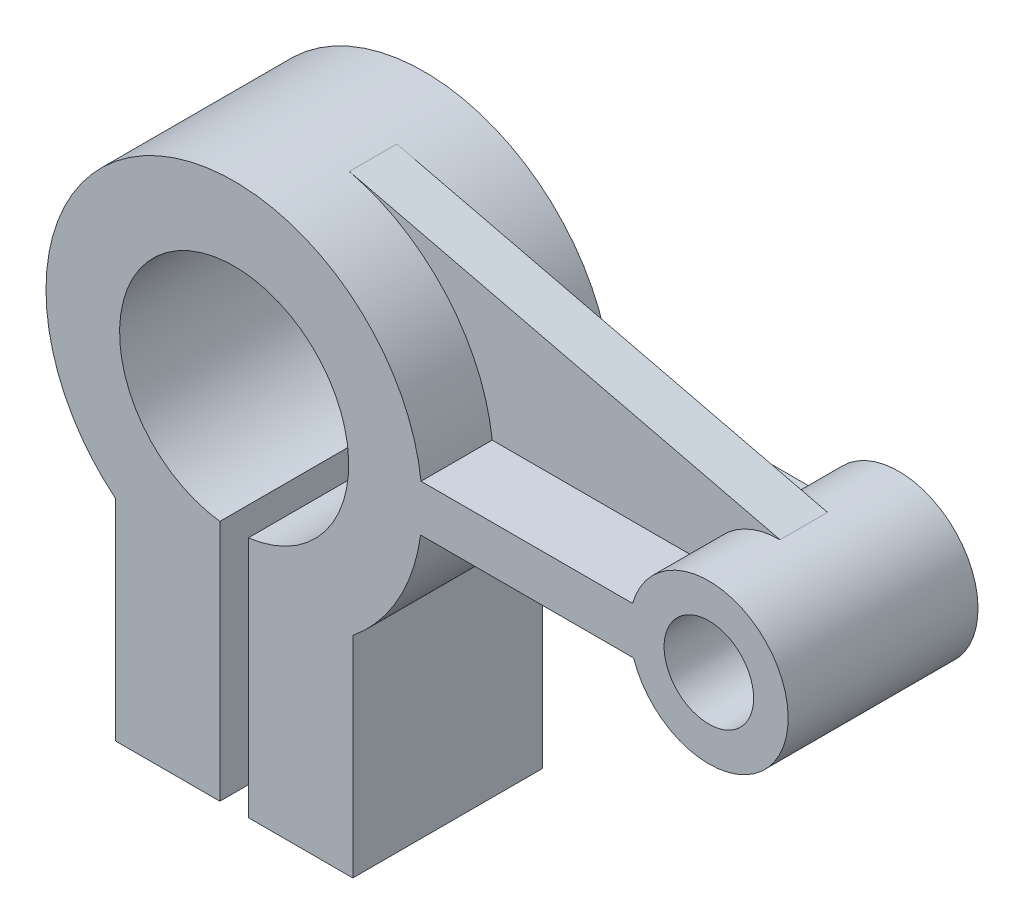
ISO-10303-21;
HEADER;
FILE_DESCRIPTION(('STEP AP214'),'2;1');
FILE_NAME('part.step','',(''),(''),'','','');
FILE_SCHEMA(('AUTOMOTIVE_DESIGN { 1 0 10303 214 1 1 1 1 }'));
ENDSEC;
DATA;
#1=APPLICATION_CONTEXT('core data for automotive mechanical design processes');
#2=APPLICATION_PROTOCOL_DEFINITION('international standard','automotive_design',2000,#1);
#3=PRODUCT_CONTEXT('',#1,'mechanical');
#4=PRODUCT('Part','Part','',(#3));
#5=PRODUCT_RELATED_PRODUCT_CATEGORY('part','',(#4));
#6=PRODUCT_DEFINITION_FORMATION('','',#4);
#7=PRODUCT_DEFINITION_CONTEXT('part definition',#1,'design');
#8=PRODUCT_DEFINITION('design','',#6,#7);
#9=PRODUCT_DEFINITION_SHAPE('','',#8);
#10=(LENGTH_UNIT() NAMED_UNIT(*) SI_UNIT(.MILLI.,.METRE.));
#11=(NAMED_UNIT(*) PLANE_ANGLE_UNIT() SI_UNIT($,.RADIAN.));
#12=(NAMED_UNIT(*) SI_UNIT($,.STERADIAN.) SOLID_ANGLE_UNIT());
#13=UNCERTAINTY_MEASURE_WITH_UNIT(LENGTH_MEASURE(1.E-05),#10,'distance_accuracy_value','');
#14=(GEOMETRIC_REPRESENTATION_CONTEXT(3) GLOBAL_UNCERTAINTY_ASSIGNED_CONTEXT((#13)) GLOBAL_UNIT_ASSIGNED_CONTEXT((#10,
#11,#12)) REPRESENTATION_CONTEXT('',''));
#15=CARTESIAN_POINT('',(0.,0.,0.));
#16=DIRECTION('',(0.,0.,1.));
#17=DIRECTION('',(1.,0.,0.));
#18=AXIS2_PLACEMENT_3D('',#15,#16,#17);
#19=CARTESIAN_POINT('',(-47.8154748154259,9.85006555532837,20.));
#20=DIRECTION('',(0.,1.,0.));
#21=DIRECTION('',(-1.,0.,0.));
#22=AXIS2_PLACEMENT_3D('',#19,#20,#21);
#23=PLANE('',#22);
#24=DIRECTION('',(0.,0.,-1.));
#25=VECTOR('',#24,1.);
#26=CARTESIAN_POINT('',(-47.8154748154259,9.85006555532837,20.));
#27=LINE('',#26,#25);
#28=CARTESIAN_POINT('',(-47.8154748154259,9.85006555532837,-5.));
#29=VERTEX_POINT('',#28);
#30=CARTESIAN_POINT('',(-47.8154748154259,9.85006555532837,-20.));
#31=VERTEX_POINT('',#30);
#32=EDGE_CURVE('E158',#29,#31,#27,.T.);
#33=ORIENTED_EDGE('',*,*,#32,.F.);
#34=DIRECTION('',(1.,0.,0.));
#35=VECTOR('',#34,1.);
#36=CARTESIAN_POINT('',(-47.8154748154259,9.85006555532837,-5.));
#37=LINE('',#36,#35);
#38=CARTESIAN_POINT('',(-3.24864638397685,9.85006555532837,-5.));
#39=VERTEX_POINT('',#38);
#40=EDGE_CURVE('E157',#29,#39,#37,.T.);
#41=ORIENTED_EDGE('',*,*,#40,.T.);
#42=DIRECTION('',(0.,0.,-1.));
#43=VECTOR('',#42,1.);
#44=CARTESIAN_POINT('',(-3.24864638397685,9.85006555532838,20.));
#45=LINE('',#44,#43);
#46=CARTESIAN_POINT('',(-3.24864638397685,9.85006555532838,-20.));
#47=VERTEX_POINT('',#46);
#48=EDGE_CURVE('E142',#39,#47,#45,.T.);
#49=ORIENTED_EDGE('',*,*,#48,.T.);
#50=DIRECTION('',(1.,0.,0.));
#51=VECTOR('',#50,1.);
#52=CARTESIAN_POINT('',(-47.8154748154259,9.85006555532837,-20.));
#53=LINE('',#52,#51);
#54=EDGE_CURVE('E183',#31,#47,#53,.T.);
#55=ORIENTED_EDGE('',*,*,#54,.F.);
#56=EDGE_LOOP('',(#33,#41,#49,#55));
#57=FACE_BOUND('',#56,.T.);
#58=ADVANCED_FACE('F32',(#57),#23,.T.);
#59=DIRECTION('',(1.,0.,0.));
#60=VECTOR('',#59,1.);
#61=CARTESIAN_POINT('',(-47.8154748154259,9.85006555532837,5.));
#62=LINE('',#61,#60);
#63=CARTESIAN_POINT('',(-47.8154748154259,9.85006555532837,5.));
#64=VERTEX_POINT('',#63);
#65=CARTESIAN_POINT('',(-3.24864638397685,9.85006555532838,5.));
#66=VERTEX_POINT('',#65);
#67=EDGE_CURVE('E167',#64,#66,#62,.T.);
#68=ORIENTED_EDGE('',*,*,#67,.F.);
#69=CARTESIAN_POINT('',(-47.8154748154259,9.85006555532837,20.));
#70=VERTEX_POINT('',#69);
#71=EDGE_CURVE('E40',#70,#64,#27,.T.);
#72=ORIENTED_EDGE('',*,*,#71,.F.);
#73=DIRECTION('',(1.,0.,0.));
#74=VECTOR('',#73,1.);
#75=CARTESIAN_POINT('',(-47.8154748154259,9.85006555532837,20.));
#76=LINE('',#75,#74);
#77=CARTESIAN_POINT('',(-3.24864638397685,9.85006555532838,20.));
#78=VERTEX_POINT('',#77);
#79=EDGE_CURVE('E186',#70,#78,#76,.T.);
#80=ORIENTED_EDGE('',*,*,#79,.T.);
#81=EDGE_CURVE('E153',#78,#66,#45,.T.);
#82=ORIENTED_EDGE('',*,*,#81,.T.);
#83=EDGE_LOOP('',(#68,#72,#80,#82));
#84=FACE_BOUND('',#83,.T.);
#85=ADVANCED_FACE('F34',(#84),#23,.T.);
#86=CARTESIAN_POINT('',(-87.1826991693036,5.28960174940764,20.));
#87=DIRECTION('',(0.,0.,-1.));
#88=DIRECTION('',(-1.,0.,0.));
#89=AXIS2_PLACEMENT_3D('',#86,#87,#88);
#90=CYLINDRICAL_SURFACE('',#89,39.630495624628);
#91=CARTESIAN_POINT('',(-87.1826991693036,5.28960174940764,5.));
#92=DIRECTION('',(0.,0.,1.));
#93=DIRECTION('',(1.,0.,0.));
#94=AXIS2_PLACEMENT_3D('',#91,#92,#93);
#95=CIRCLE('',#94,39.630495624628);
#96=CARTESIAN_POINT('',(-77.9118512435752,43.8204668083662,5.));
#97=VERTEX_POINT('',#96);
#98=EDGE_CURVE('E47',#64,#97,#95,.T.);
#99=ORIENTED_EDGE('',*,*,#98,.T.);
#100=DIRECTION('',(0.,0.,-1.));
#101=VECTOR('',#100,1.);
#102=CARTESIAN_POINT('',(-77.9118512435752,43.8204668083662,20.));
#103=LINE('',#102,#101);
#104=CARTESIAN_POINT('',(-77.9118512435752,43.8204668083662,-5.));
#105=VERTEX_POINT('',#104);
#106=EDGE_CURVE('E51',#105,#97,#103,.F.);
#107=ORIENTED_EDGE('',*,*,#106,.F.);
#108=CARTESIAN_POINT('',(-87.1826991693036,5.28960174940764,-5.));
#109=DIRECTION('',(0.,0.,1.));
#110=DIRECTION('',(1.,0.,0.));
#111=AXIS2_PLACEMENT_3D('',#108,#109,#110);
#112=CIRCLE('',#111,39.630495624628);
#113=EDGE_CURVE('E160',#29,#105,#112,.T.);
#114=ORIENTED_EDGE('',*,*,#113,.F.);
#115=ORIENTED_EDGE('',*,*,#32,.T.);
#116=CARTESIAN_POINT('',(-87.1826991693036,5.28960174940764,-20.));
#117=DIRECTION('',(0.,0.,1.));
#118=DIRECTION('',(1.,0.,0.));
#119=AXIS2_PLACEMENT_3D('',#116,#117,#118);
#120=CIRCLE('',#119,39.630495624628);
#121=CARTESIAN_POINT('',(-112.182699169304,-25.4606207449688,-20.));
#122=VERTEX_POINT('',#121);
#123=EDGE_CURVE('E190',#31,#122,#120,.T.);
#124=ORIENTED_EDGE('',*,*,#123,.T.);
#125=DIRECTION('',(0.,0.,-1.));
#126=VECTOR('',#125,1.);
#127=CARTESIAN_POINT('',(-112.182699169304,-25.4606207449688,20.));
#128=LINE('',#127,#126);
#129=CARTESIAN_POINT('',(-112.182699169304,-25.4606207449688,20.));
#130=VERTEX_POINT('',#129);
#131=EDGE_CURVE('E248',#130,#122,#128,.T.);
#132=ORIENTED_EDGE('',*,*,#131,.F.);
#133=CARTESIAN_POINT('',(-87.1826991693036,5.28960174940764,20.));
#134=DIRECTION('',(0.,0.,1.));
#135=DIRECTION('',(1.,0.,0.));
#136=AXIS2_PLACEMENT_3D('',#133,#134,#135);
#137=CIRCLE('',#136,39.630495624628);
#138=EDGE_CURVE('E154',#70,#130,#137,.T.);
#139=ORIENTED_EDGE('',*,*,#138,.F.);
#140=ORIENTED_EDGE('',*,*,#71,.T.);
#141=EDGE_LOOP('',(#99,#107,#114,#115,#124,#132,#139,#140));
#142=FACE_BOUND('',#141,.T.);
#143=ADVANCED_FACE('F295',(#142),#90,.T.);
#144=CARTESIAN_POINT('',(-112.182699169304,-69.7103982505924,20.));
#145=DIRECTION('',(-1.,0.,0.));
#146=DIRECTION('',(0.,0.,1.));
#147=AXIS2_PLACEMENT_3D('',#144,#145,#146);
#148=PLANE('',#147);
#149=ORIENTED_EDGE('',*,*,#131,.T.);
#150=DIRECTION('',(0.,1.,0.));
#151=VECTOR('',#150,1.);
#152=CARTESIAN_POINT('',(-112.182699169304,-69.7103982505924,-20.));
#153=LINE('',#152,#151);
#154=CARTESIAN_POINT('',(-112.182699169304,-69.7103982505924,-20.));
#155=VERTEX_POINT('',#154);
#156=EDGE_CURVE('E242',#155,#122,#153,.T.);
#157=ORIENTED_EDGE('',*,*,#156,.F.);
#158=DIRECTION('',(0.,0.,-1.));
#159=VECTOR('',#158,1.);
#160=CARTESIAN_POINT('',(-112.182699169304,-69.7103982505924,20.));
#161=LINE('',#160,#159);
#162=CARTESIAN_POINT('',(-112.182699169304,-69.7103982505924,20.));
#163=VERTEX_POINT('',#162);
#164=EDGE_CURVE('E250',#163,#155,#161,.T.);
#165=ORIENTED_EDGE('',*,*,#164,.F.);
#166=DIRECTION('',(0.,1.,0.));
#167=VECTOR('',#166,1.);
#168=CARTESIAN_POINT('',(-112.182699169304,-69.7103982505924,20.));
#169=LINE('',#168,#167);
#170=EDGE_CURVE('E212',#163,#130,#169,.T.);
#171=ORIENTED_EDGE('',*,*,#170,.T.);
#172=EDGE_LOOP('',(#149,#157,#165,#171));
#173=FACE_BOUND('',#172,.T.);
#174=ADVANCED_FACE('F299',(#173),#148,.T.);
#175=CARTESIAN_POINT('',(-112.182699169304,-69.7103982505924,20.));
#176=DIRECTION('',(0.,1.,0.));
#177=DIRECTION('',(0.,0.,1.));
#178=AXIS2_PLACEMENT_3D('',#175,#176,#177);
#179=PLANE('',#178);
#180=ORIENTED_EDGE('',*,*,#164,.T.);
#181=DIRECTION('',(1.,0.,0.));
#182=VECTOR('',#181,1.);
#183=CARTESIAN_POINT('',(-112.182699169304,-69.7103982505924,-20.));
#184=LINE('',#183,#182);
#185=CARTESIAN_POINT('',(-90.1826991693036,-69.7103982505924,-20.));
#186=VERTEX_POINT('',#185);
#187=EDGE_CURVE('E239',#155,#186,#184,.T.);
#188=ORIENTED_EDGE('',*,*,#187,.T.);
#189=DIRECTION('',(0.,0.,-1.));
#190=VECTOR('',#189,1.);
#191=CARTESIAN_POINT('',(-90.1826991693036,-69.7103982505924,20.));
#192=LINE('',#191,#190);
#193=CARTESIAN_POINT('',(-90.1826991693036,-69.7103982505924,20.));
#194=VERTEX_POINT('',#193);
#195=EDGE_CURVE('E252',#194,#186,#192,.T.);
#196=ORIENTED_EDGE('',*,*,#195,.F.);
#197=DIRECTION('',(1.,0.,0.));
#198=VECTOR('',#197,1.);
#199=CARTESIAN_POINT('',(-112.182699169304,-69.7103982505924,20.));
#200=LINE('',#199,#198);
#201=EDGE_CURVE('E210',#163,#194,#200,.T.);
#202=ORIENTED_EDGE('',*,*,#201,.F.);
#203=EDGE_LOOP('',(#180,#188,#196,#202));
#204=FACE_BOUND('',#203,.T.);
#205=ADVANCED_FACE('F304',(#204),#179,.F.);
#206=CARTESIAN_POINT('',(-90.1826991693036,-18.6578053594884,20.));
#207=DIRECTION('',(1.,0.,0.));
#208=DIRECTION('',(0.,1.,0.));
#209=AXIS2_PLACEMENT_3D('',#206,#207,#208);
#210=PLANE('',#209);
#211=ORIENTED_EDGE('',*,*,#195,.T.);
#212=DIRECTION('',(0.,-1.,0.));
#213=VECTOR('',#212,1.);
#214=CARTESIAN_POINT('',(-90.1826991693036,-18.6578053594884,-20.));
#215=LINE('',#214,#213);
#216=CARTESIAN_POINT('',(-90.1826991693036,-18.6578053594884,-20.));
#217=VERTEX_POINT('',#216);
#218=EDGE_CURVE('E236',#217,#186,#215,.T.);
#219=ORIENTED_EDGE('',*,*,#218,.F.);
#220=DIRECTION('',(0.,0.,-1.));
#221=VECTOR('',#220,1.);
#222=CARTESIAN_POINT('',(-90.1826991693036,-18.6578053594884,20.));
#223=LINE('',#222,#221);
#224=CARTESIAN_POINT('',(-90.1826991693036,-18.6578053594884,20.));
#225=VERTEX_POINT('',#224);
#226=EDGE_CURVE('E254',#225,#217,#223,.T.);
#227=ORIENTED_EDGE('',*,*,#226,.F.);
#228=DIRECTION('',(0.,-1.,0.));
#229=VECTOR('',#228,1.);
#230=CARTESIAN_POINT('',(-90.1826991693036,-18.6578053594884,20.));
#231=LINE('',#230,#229);
#232=EDGE_CURVE('E207',#225,#194,#231,.T.);
#233=ORIENTED_EDGE('',*,*,#232,.T.);
#234=EDGE_LOOP('',(#211,#219,#227,#233));
#235=FACE_BOUND('',#234,.T.);
#236=ADVANCED_FACE('F312',(#235),#210,.T.);
#237=CARTESIAN_POINT('',(-87.1826991693036,5.28960174940764,20.));
#238=DIRECTION('',(0.,0.,-1.));
#239=DIRECTION('',(-1.,0.,0.));
#240=AXIS2_PLACEMENT_3D('',#237,#238,#239);
#241=CYLINDRICAL_SURFACE('',#240,24.1345873641794);
#242=ORIENTED_EDGE('',*,*,#226,.T.);
#243=CARTESIAN_POINT('',(-87.1826991693036,5.28960174940764,-20.));
#244=DIRECTION('',(0.,0.,1.));
#245=DIRECTION('',(1.,0.,0.));
#246=AXIS2_PLACEMENT_3D('',#243,#244,#245);
#247=CIRCLE('',#246,24.1345873641794);
#248=CARTESIAN_POINT('',(-84.1826991693036,-18.6578053594884,-20.));
#249=VERTEX_POINT('',#248);
#250=EDGE_CURVE('E233',#249,#217,#247,.T.);
#251=ORIENTED_EDGE('',*,*,#250,.F.);
#252=DIRECTION('',(0.,0.,-1.));
#253=VECTOR('',#252,1.);
#254=CARTESIAN_POINT('',(-84.1826991693036,-18.6578053594884,20.));
#255=LINE('',#254,#253);
#256=CARTESIAN_POINT('',(-84.1826991693036,-18.6578053594884,20.));
#257=VERTEX_POINT('',#256);
#258=EDGE_CURVE('E256',#257,#249,#255,.T.);
#259=ORIENTED_EDGE('',*,*,#258,.F.);
#260=CARTESIAN_POINT('',(-87.1826991693036,5.28960174940764,20.));
#261=DIRECTION('',(0.,0.,1.));
#262=DIRECTION('',(1.,0.,0.));
#263=AXIS2_PLACEMENT_3D('',#260,#261,#262);
#264=CIRCLE('',#263,24.1345873641794);
#265=EDGE_CURVE('E204',#257,#225,#264,.T.);
#266=ORIENTED_EDGE('',*,*,#265,.T.);
#267=EDGE_LOOP('',(#242,#251,#259,#266));
#268=FACE_BOUND('',#267,.T.);
#269=ADVANCED_FACE('F316',(#268),#241,.F.);
#270=CARTESIAN_POINT('',(-84.1826991693036,-18.6578053594884,20.));
#271=DIRECTION('',(1.,0.,0.));
#272=DIRECTION('',(0.,1.,0.));
#273=AXIS2_PLACEMENT_3D('',#270,#271,#272);
#274=PLANE('',#273);
#275=ORIENTED_EDGE('',*,*,#258,.T.);
#276=DIRECTION('',(0.,-1.,0.));
#277=VECTOR('',#276,1.);
#278=CARTESIAN_POINT('',(-84.1826991693036,-18.6578053594884,-20.));
#279=LINE('',#278,#277);
#280=CARTESIAN_POINT('',(-84.1826991693036,-69.7103982505924,-20.));
#281=VERTEX_POINT('',#280);
#282=EDGE_CURVE('E230',#249,#281,#279,.T.);
#283=ORIENTED_EDGE('',*,*,#282,.T.);
#284=DIRECTION('',(0.,0.,-1.));
#285=VECTOR('',#284,1.);
#286=CARTESIAN_POINT('',(-84.1826991693036,-69.7103982505924,20.));
#287=LINE('',#286,#285);
#288=CARTESIAN_POINT('',(-84.1826991693036,-69.7103982505924,20.));
#289=VERTEX_POINT('',#288);
#290=EDGE_CURVE('E258',#289,#281,#287,.T.);
#291=ORIENTED_EDGE('',*,*,#290,.F.);
#292=DIRECTION('',(0.,-1.,0.));
#293=VECTOR('',#292,1.);
#294=CARTESIAN_POINT('',(-84.1826991693036,-18.6578053594884,20.));
#295=LINE('',#294,#293);
#296=EDGE_CURVE('E202',#257,#289,#295,.T.);
#297=ORIENTED_EDGE('',*,*,#296,.F.);
#298=EDGE_LOOP('',(#275,#283,#291,#297));
#299=FACE_BOUND('',#298,.T.);
#300=ADVANCED_FACE('F320',(#299),#274,.F.);
#301=CARTESIAN_POINT('',(-62.1826991693036,-69.7103982505924,20.));
#302=DIRECTION('',(0.,-1.,0.));
#303=DIRECTION('',(0.,0.,-1.));
#304=AXIS2_PLACEMENT_3D('',#301,#302,#303);
#305=PLANE('',#304);
#306=ORIENTED_EDGE('',*,*,#290,.T.);
#307=DIRECTION('',(-1.,0.,0.));
#308=VECTOR('',#307,1.);
#309=CARTESIAN_POINT('',(-62.1826991693036,-69.7103982505924,-20.));
#310=LINE('',#309,#308);
#311=CARTESIAN_POINT('',(-62.1826991693036,-69.7103982505924,-20.));
#312=VERTEX_POINT('',#311);
#313=EDGE_CURVE('E227',#312,#281,#310,.T.);
#314=ORIENTED_EDGE('',*,*,#313,.F.);
#315=DIRECTION('',(0.,0.,-1.));
#316=VECTOR('',#315,1.);
#317=CARTESIAN_POINT('',(-62.1826991693036,-69.7103982505924,20.));
#318=LINE('',#317,#316);
#319=CARTESIAN_POINT('',(-62.1826991693036,-69.7103982505924,20.));
#320=VERTEX_POINT('',#319);
#321=EDGE_CURVE('E260',#320,#312,#318,.T.);
#322=ORIENTED_EDGE('',*,*,#321,.F.);
#323=DIRECTION('',(-1.,0.,0.));
#324=VECTOR('',#323,1.);
#325=CARTESIAN_POINT('',(-62.1826991693036,-69.7103982505924,20.));
#326=LINE('',#325,#324);
#327=EDGE_CURVE('E199',#320,#289,#326,.T.);
#328=ORIENTED_EDGE('',*,*,#327,.T.);
#329=EDGE_LOOP('',(#306,#314,#322,#328));
#330=FACE_BOUND('',#329,.T.);
#331=ADVANCED_FACE('F324',(#330),#305,.T.);
#332=CARTESIAN_POINT('',(-62.1826991693036,-69.7103982505924,20.));
#333=DIRECTION('',(-1.,0.,0.));
#334=DIRECTION('',(0.,0.,1.));
#335=AXIS2_PLACEMENT_3D('',#332,#333,#334);
#336=PLANE('',#335);
#337=ORIENTED_EDGE('',*,*,#321,.T.);
#338=DIRECTION('',(0.,1.,0.));
#339=VECTOR('',#338,1.);
#340=CARTESIAN_POINT('',(-62.1826991693036,-69.7103982505924,-20.));
#341=LINE('',#340,#339);
#342=CARTESIAN_POINT('',(-62.1826991693036,-25.4606207449688,-20.));
#343=VERTEX_POINT('',#342);
#344=EDGE_CURVE('E224',#312,#343,#341,.T.);
#345=ORIENTED_EDGE('',*,*,#344,.T.);
#346=DIRECTION('',(0.,0.,-1.));
#347=VECTOR('',#346,1.);
#348=CARTESIAN_POINT('',(-62.1826991693036,-25.4606207449688,20.));
#349=LINE('',#348,#347);
#350=CARTESIAN_POINT('',(-62.1826991693036,-25.4606207449688,20.));
#351=VERTEX_POINT('',#350);
#352=EDGE_CURVE('E262',#351,#343,#349,.T.);
#353=ORIENTED_EDGE('',*,*,#352,.F.);
#354=DIRECTION('',(0.,1.,0.));
#355=VECTOR('',#354,1.);
#356=CARTESIAN_POINT('',(-62.1826991693036,-69.7103982505924,20.));
#357=LINE('',#356,#355);
#358=EDGE_CURVE('E197',#320,#351,#357,.T.);
#359=ORIENTED_EDGE('',*,*,#358,.F.);
#360=EDGE_LOOP('',(#337,#345,#353,#359));
#361=FACE_BOUND('',#360,.T.);
#362=ADVANCED_FACE('F328',(#361),#336,.F.);
#363=CARTESIAN_POINT('',(-87.1826991693036,5.28960174940764,20.));
#364=DIRECTION('',(0.,0.,-1.));
#365=DIRECTION('',(-1.,0.,0.));
#366=AXIS2_PLACEMENT_3D('',#363,#364,#365);
#367=CYLINDRICAL_SURFACE('',#366,39.630495624628);
#368=ORIENTED_EDGE('',*,*,#352,.T.);
#369=CARTESIAN_POINT('',(-87.1826991693036,5.28960174940764,-20.));
#370=DIRECTION('',(0.,0.,1.));
#371=DIRECTION('',(1.,0.,0.));
#372=AXIS2_PLACEMENT_3D('',#369,#370,#371);
#373=CIRCLE('',#372,39.630495624628);
#374=CARTESIAN_POINT('',(-47.9067994751359,0.,-20.));
#375=VERTEX_POINT('',#374);
#376=EDGE_CURVE('E221',#343,#375,#373,.T.);
#377=ORIENTED_EDGE('',*,*,#376,.T.);
#378=DIRECTION('',(0.,0.,-1.));
#379=VECTOR('',#378,1.);
#380=CARTESIAN_POINT('',(-47.9067994751359,0.,20.));
#381=LINE('',#380,#379);
#382=CARTESIAN_POINT('',(-47.9067994751359,0.,20.));
#383=VERTEX_POINT('',#382);
#384=EDGE_CURVE('E264',#383,#375,#381,.T.);
#385=ORIENTED_EDGE('',*,*,#384,.F.);
#386=CARTESIAN_POINT('',(-87.1826991693036,5.28960174940764,20.));
#387=DIRECTION('',(0.,0.,1.));
#388=DIRECTION('',(1.,0.,0.));
#389=AXIS2_PLACEMENT_3D('',#386,#387,#388);
#390=CIRCLE('',#389,39.630495624628);
#391=EDGE_CURVE('E195',#351,#383,#390,.T.);
#392=ORIENTED_EDGE('',*,*,#391,.F.);
#393=EDGE_LOOP('',(#368,#377,#385,#392));
#394=FACE_BOUND('',#393,.T.);
#395=ADVANCED_FACE('F332',(#394),#367,.T.);
#396=CARTESIAN_POINT('',(-3.02355152523584,0.,20.));
#397=DIRECTION('',(0.,-1.,0.));
#398=DIRECTION('',(0.,0.,-1.));
#399=AXIS2_PLACEMENT_3D('',#396,#397,#398);
#400=PLANE('',#399);
#401=ORIENTED_EDGE('',*,*,#384,.T.);
#402=DIRECTION('',(-1.,0.,0.));
#403=VECTOR('',#402,1.);
#404=CARTESIAN_POINT('',(-3.02355152523584,0.,-20.));
#405=LINE('',#404,#403);
#406=CARTESIAN_POINT('',(-3.02355152523584,0.,-20.));
#407=VERTEX_POINT('',#406);
#408=EDGE_CURVE('E218',#407,#375,#405,.T.);
#409=ORIENTED_EDGE('',*,*,#408,.F.);
#410=DIRECTION('',(0.,0.,-1.));
#411=VECTOR('',#410,1.);
#412=CARTESIAN_POINT('',(-3.02355152523584,0.,20.));
#413=LINE('',#412,#411);
#414=CARTESIAN_POINT('',(-3.02355152523584,0.,20.));
#415=VERTEX_POINT('',#414);
#416=EDGE_CURVE('E266',#415,#407,#413,.T.);
#417=ORIENTED_EDGE('',*,*,#416,.F.);
#418=DIRECTION('',(-1.,0.,0.));
#419=VECTOR('',#418,1.);
#420=CARTESIAN_POINT('',(-3.02355152523584,0.,20.));
#421=LINE('',#420,#419);
#422=EDGE_CURVE('E192',#415,#383,#421,.T.);
#423=ORIENTED_EDGE('',*,*,#422,.T.);
#424=EDGE_LOOP('',(#401,#409,#417,#423));
#425=FACE_BOUND('',#424,.T.);
#426=ADVANCED_FACE('F336',(#425),#400,.T.);
#427=CARTESIAN_POINT('',(12.8173008306964,5.28960174940764,20.));
#428=DIRECTION('',(0.,0.,-1.));
#429=DIRECTION('',(-1.,0.,0.));
#430=AXIS2_PLACEMENT_3D('',#427,#428,#429);
#431=CYLINDRICAL_SURFACE('',#430,16.7006733406105);
#432=DIRECTION('',(0.,0.,-1.));
#433=VECTOR('',#432,1.);
#434=CARTESIAN_POINT('',(12.8173008306964,21.9902750900182,20.));
#435=LINE('',#434,#433);
#436=CARTESIAN_POINT('',(12.8173008306964,21.9902750900182,-5.));
#437=VERTEX_POINT('',#436);
#438=CARTESIAN_POINT('',(12.8173008306964,21.9902750900182,5.));
#439=VERTEX_POINT('',#438);
#440=EDGE_CURVE('E11',#437,#439,#435,.F.);
#441=ORIENTED_EDGE('',*,*,#440,.T.);
#442=CARTESIAN_POINT('',(12.8173008306964,5.28960174940764,5.));
#443=DIRECTION('',(0.,0.,1.));
#444=DIRECTION('',(1.,0.,0.));
#445=AXIS2_PLACEMENT_3D('',#442,#443,#444);
#446=CIRCLE('',#445,16.7006733406105);
#447=EDGE_CURVE('E174',#439,#66,#446,.T.);
#448=ORIENTED_EDGE('',*,*,#447,.T.);
#449=ORIENTED_EDGE('',*,*,#81,.F.);
#450=CARTESIAN_POINT('',(12.8173008306964,5.28960174940764,20.));
#451=DIRECTION('',(0.,0.,1.));
#452=DIRECTION('',(1.,0.,0.));
#453=AXIS2_PLACEMENT_3D('',#450,#451,#452);
#454=CIRCLE('',#453,16.7006733406105);
#455=EDGE_CURVE('E189',#415,#78,#454,.T.);
#456=ORIENTED_EDGE('',*,*,#455,.F.);
#457=ORIENTED_EDGE('',*,*,#416,.T.);
#458=CARTESIAN_POINT('',(12.8173008306964,5.28960174940764,-20.));
#459=DIRECTION('',(0.,0.,1.));
#460=DIRECTION('',(1.,0.,0.));
#461=AXIS2_PLACEMENT_3D('',#458,#459,#460);
#462=CIRCLE('',#461,16.7006733406105);
#463=EDGE_CURVE('E149',#407,#47,#462,.T.);
#464=ORIENTED_EDGE('',*,*,#463,.T.);
#465=ORIENTED_EDGE('',*,*,#48,.F.);
#466=CARTESIAN_POINT('',(12.8173008306964,5.28960174940764,-5.));
#467=DIRECTION('',(0.,0.,1.));
#468=DIRECTION('',(1.,0.,0.));
#469=AXIS2_PLACEMENT_3D('',#466,#467,#468);
#470=CIRCLE('',#469,16.7006733406105);
#471=EDGE_CURVE('E146',#437,#39,#470,.T.);
#472=ORIENTED_EDGE('',*,*,#471,.F.);
#473=EDGE_LOOP('',(#441,#448,#449,#456,#457,#464,#465,#472));
#474=FACE_BOUND('',#473,.T.);
#475=ADVANCED_FACE('F144',(#474),#431,.T.);
#476=CARTESIAN_POINT('',(12.8173008306964,5.28960174940764,20.));
#477=DIRECTION('',(0.,0.,1.));
#478=DIRECTION('',(1.,0.,0.));
#479=AXIS2_PLACEMENT_3D('',#476,#477,#478);
#480=PLANE('',#479);
#481=CARTESIAN_POINT('',(12.8173008306964,5.28960174940764,20.));
#482=DIRECTION('',(0.,0.,1.));
#483=DIRECTION('',(1.,0.,0.));
#484=AXIS2_PLACEMENT_3D('',#481,#482,#483);
#485=CIRCLE('',#484,9.42757318913256);
#486=CARTESIAN_POINT('',(22.2448740198289,5.28960174940764,20.));
#487=VERTEX_POINT('',#486);
#488=EDGE_CURVE('E179',#487,#487,#485,.T.);
#489=ORIENTED_EDGE('',*,*,#488,.F.);
#490=EDGE_LOOP('',(#489));
#491=FACE_BOUND('',#490,.T.);
#492=ORIENTED_EDGE('',*,*,#79,.F.);
#493=ORIENTED_EDGE('',*,*,#138,.T.);
#494=ORIENTED_EDGE('',*,*,#170,.F.);
#495=ORIENTED_EDGE('',*,*,#201,.T.);
#496=ORIENTED_EDGE('',*,*,#232,.F.);
#497=ORIENTED_EDGE('',*,*,#265,.F.);
#498=ORIENTED_EDGE('',*,*,#296,.T.);
#499=ORIENTED_EDGE('',*,*,#327,.F.);
#500=ORIENTED_EDGE('',*,*,#358,.T.);
#501=ORIENTED_EDGE('',*,*,#391,.T.);
#502=ORIENTED_EDGE('',*,*,#422,.F.);
#503=ORIENTED_EDGE('',*,*,#455,.T.);
#504=EDGE_LOOP('',(#492,#493,#494,#495,#496,#497,#498,#499,#500,#501,#502,#503));
#505=FACE_BOUND('',#504,.T.);
#506=ADVANCED_FACE('F341',(#491,#505),#480,.T.);
#507=CARTESIAN_POINT('',(12.8173008306964,5.28960174940764,-20.));
#508=DIRECTION('',(0.,0.,1.));
#509=DIRECTION('',(1.,0.,0.));
#510=AXIS2_PLACEMENT_3D('',#507,#508,#509);
#511=PLANE('',#510);
#512=CARTESIAN_POINT('',(12.8173008306964,5.28960174940764,-20.));
#513=DIRECTION('',(0.,0.,1.));
#514=DIRECTION('',(1.,0.,0.));
#515=AXIS2_PLACEMENT_3D('',#512,#513,#514);
#516=CIRCLE('',#515,9.42757318913256);
#517=CARTESIAN_POINT('',(22.2448740198289,5.28960174940764,-20.));
#518=VERTEX_POINT('',#517);
#519=EDGE_CURVE('E180',#518,#518,#516,.T.);
#520=ORIENTED_EDGE('',*,*,#519,.T.);
#521=EDGE_LOOP('',(#520));
#522=FACE_BOUND('',#521,.T.);
#523=ORIENTED_EDGE('',*,*,#54,.T.);
#524=ORIENTED_EDGE('',*,*,#463,.F.);
#525=ORIENTED_EDGE('',*,*,#408,.T.);
#526=ORIENTED_EDGE('',*,*,#376,.F.);
#527=ORIENTED_EDGE('',*,*,#344,.F.);
#528=ORIENTED_EDGE('',*,*,#313,.T.);
#529=ORIENTED_EDGE('',*,*,#282,.F.);
#530=ORIENTED_EDGE('',*,*,#250,.T.);
#531=ORIENTED_EDGE('',*,*,#218,.T.);
#532=ORIENTED_EDGE('',*,*,#187,.F.);
#533=ORIENTED_EDGE('',*,*,#156,.T.);
#534=ORIENTED_EDGE('',*,*,#123,.F.);
#535=EDGE_LOOP('',(#523,#524,#525,#526,#527,#528,#529,#530,#531,#532,#533,#534));
#536=FACE_BOUND('',#535,.T.);
#537=ADVANCED_FACE('F287',(#522,#536),#511,.F.);
#538=CARTESIAN_POINT('',(12.8173008306964,5.28960174940764,-20.));
#539=DIRECTION('',(0.,0.,1.));
#540=DIRECTION('',(1.,0.,0.));
#541=AXIS2_PLACEMENT_3D('',#538,#539,#540);
#542=CYLINDRICAL_SURFACE('',#541,9.42757318913256);
#543=ORIENTED_EDGE('',*,*,#488,.T.);
#544=EDGE_LOOP('',(#543));
#545=FACE_BOUND('',#544,.T.);
#546=ORIENTED_EDGE('',*,*,#519,.F.);
#547=EDGE_LOOP('',(#546));
#548=FACE_BOUND('',#547,.T.);
#549=ADVANCED_FACE('F280',(#545,#548),#542,.F.);
#550=CARTESIAN_POINT('',(-77.9118512435752,43.8204668083662,0.));
#551=DIRECTION('',(-0.233932172172159,-0.972252919163947,0.));
#552=DIRECTION('',(0.972252919163947,-0.233932172172159,0.));
#553=AXIS2_PLACEMENT_3D('',#550,#551,#552);
#554=PLANE('',#553);
#555=DIRECTION('',(0.972252919163947,-0.233932172172159,0.));
#556=VECTOR('',#555,1.);
#557=CARTESIAN_POINT('',(-77.9118512435752,43.8204668083662,-5.));
#558=LINE('',#557,#556);
#559=EDGE_CURVE('E165',#105,#437,#558,.T.);
#560=ORIENTED_EDGE('',*,*,#559,.F.);
#561=ORIENTED_EDGE('',*,*,#106,.T.);
#562=DIRECTION('',(0.972252919163947,-0.233932172172159,0.));
#563=VECTOR('',#562,1.);
#564=CARTESIAN_POINT('',(-77.9118512435752,43.8204668083662,5.));
#565=LINE('',#564,#563);
#566=EDGE_CURVE('E172',#97,#439,#565,.T.);
#567=ORIENTED_EDGE('',*,*,#566,.T.);
#568=ORIENTED_EDGE('',*,*,#440,.F.);
#569=EDGE_LOOP('',(#560,#561,#567,#568));
#570=FACE_BOUND('',#569,.T.);
#571=ADVANCED_FACE('F278',(#570),#554,.F.);
#572=CARTESIAN_POINT('',(-48.6476103113123,-12.3951504382784,5.));
#573=DIRECTION('',(0.,0.,1.));
#574=DIRECTION('',(1.,0.,0.));
#575=AXIS2_PLACEMENT_3D('',#572,#573,#574);
#576=PLANE('',#575);
#577=ORIENTED_EDGE('',*,*,#447,.F.);
#578=ORIENTED_EDGE('',*,*,#566,.F.);
#579=ORIENTED_EDGE('',*,*,#98,.F.);
#580=ORIENTED_EDGE('',*,*,#67,.T.);
#581=EDGE_LOOP('',(#577,#578,#579,#580));
#582=FACE_BOUND('',#581,.T.);
#583=ADVANCED_FACE('F274',(#582),#576,.T.);
#584=CARTESIAN_POINT('',(-48.6476103113123,-12.3951504382784,-5.));
#585=DIRECTION('',(0.,0.,1.));
#586=DIRECTION('',(1.,0.,0.));
#587=AXIS2_PLACEMENT_3D('',#584,#585,#586);
#588=PLANE('',#587);
#589=ORIENTED_EDGE('',*,*,#559,.T.);
#590=ORIENTED_EDGE('',*,*,#471,.T.);
#591=ORIENTED_EDGE('',*,*,#40,.F.);
#592=ORIENTED_EDGE('',*,*,#113,.T.);
#593=EDGE_LOOP('',(#589,#590,#591,#592));
#594=FACE_BOUND('',#593,.T.);
#595=ADVANCED_FACE('F163',(#594),#588,.F.);
#596=CLOSED_SHELL('',(#58,#85,#143,#174,#205,#236,#269,#300,#331,#362,#395,#426,#475,#506,#537,
#549,#571,#583,#595));
#597=MANIFOLD_SOLID_BREP('B2',#596);
#598=ADVANCED_BREP_SHAPE_REPRESENTATION('',(#18,#597),#14);
#599=SHAPE_DEFINITION_REPRESENTATION(#9,#598);
ENDSEC;
END-ISO-10303-21;
